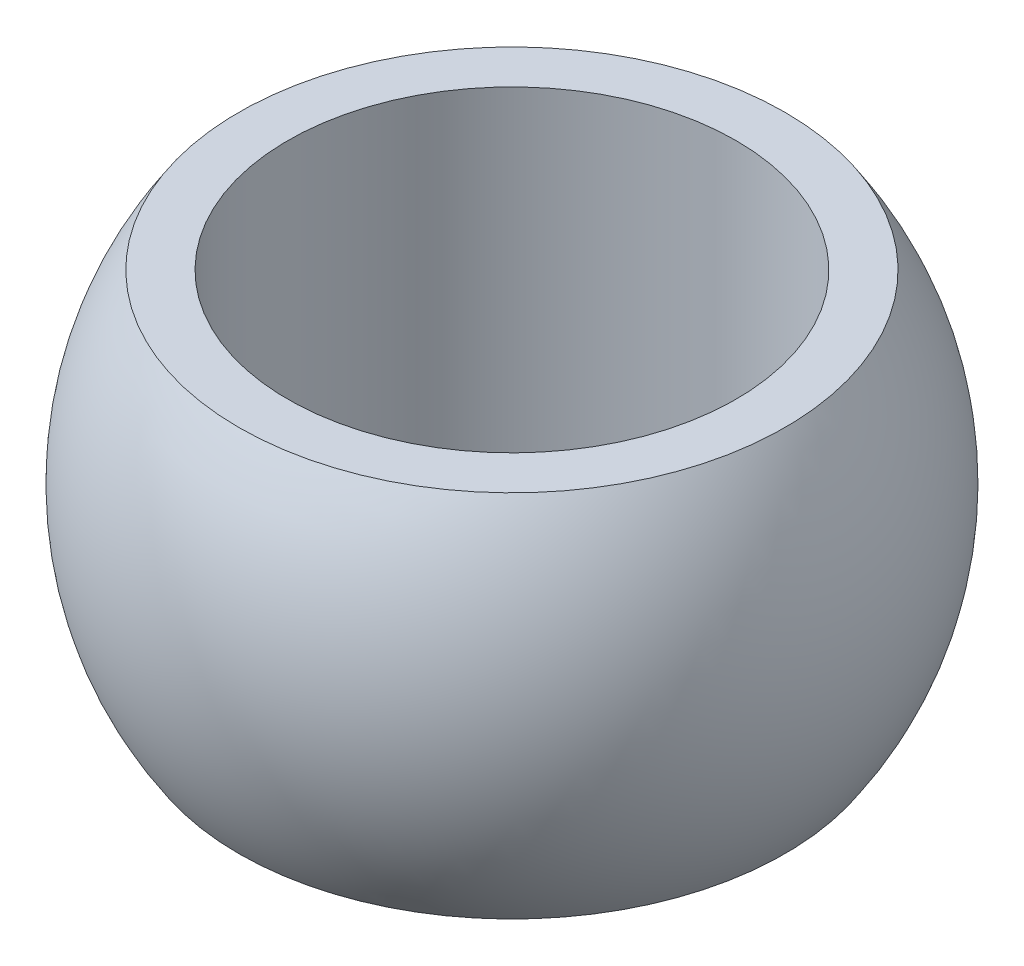
ISO-10303-21;
HEADER;
FILE_DESCRIPTION(('STEP AP214'),'2;1');
FILE_NAME('part.step','',(''),(''),'','','');
FILE_SCHEMA(('AUTOMOTIVE_DESIGN { 1 0 10303 214 1 1 1 1 }'));
ENDSEC;
DATA;
#1=APPLICATION_CONTEXT('core data for automotive mechanical design processes');
#2=APPLICATION_PROTOCOL_DEFINITION('international standard','automotive_design',2000,#1);
#3=PRODUCT_CONTEXT('',#1,'mechanical');
#4=PRODUCT('Part','Part','',(#3));
#5=PRODUCT_RELATED_PRODUCT_CATEGORY('part','',(#4));
#6=PRODUCT_DEFINITION_FORMATION('','',#4);
#7=PRODUCT_DEFINITION_CONTEXT('part definition',#1,'design');
#8=PRODUCT_DEFINITION('design','',#6,#7);
#9=PRODUCT_DEFINITION_SHAPE('','',#8);
#10=(LENGTH_UNIT() NAMED_UNIT(*) SI_UNIT(.MILLI.,.METRE.));
#11=(NAMED_UNIT(*) PLANE_ANGLE_UNIT() SI_UNIT($,.RADIAN.));
#12=(NAMED_UNIT(*) SI_UNIT($,.STERADIAN.) SOLID_ANGLE_UNIT());
#13=UNCERTAINTY_MEASURE_WITH_UNIT(LENGTH_MEASURE(1.E-05),#10,'distance_accuracy_value','');
#14=(GEOMETRIC_REPRESENTATION_CONTEXT(3) GLOBAL_UNCERTAINTY_ASSIGNED_CONTEXT((#13)) GLOBAL_UNIT_ASSIGNED_CONTEXT((#10,
#11,#12)) REPRESENTATION_CONTEXT('',''));
#15=CARTESIAN_POINT('',(0.,0.,0.));
#16=DIRECTION('',(0.,0.,1.));
#17=DIRECTION('',(1.,0.,0.));
#18=AXIS2_PLACEMENT_3D('',#15,#16,#17);
#19=CARTESIAN_POINT('',(0.,-15.339775558856,0.));
#20=DIRECTION('',(0.,-1.,0.));
#21=DIRECTION('',(0.,0.,-1.));
#22=AXIS2_PLACEMENT_3D('',#19,#20,#21);
#23=CYLINDRICAL_SURFACE('',#22,8.5);
#24=CARTESIAN_POINT('',(0.,-7.,0.));
#25=DIRECTION('',(0.,-1.,0.));
#26=DIRECTION('',(0.,0.,-1.));
#27=AXIS2_PLACEMENT_3D('',#24,#25,#26);
#28=CIRCLE('',#27,8.5);
#29=CARTESIAN_POINT('',(0.,-7.,-8.5));
#30=VERTEX_POINT('',#29);
#31=EDGE_CURVE('E10',#30,#30,#28,.T.);
#32=ORIENTED_EDGE('',*,*,#31,.T.);
#33=EDGE_LOOP('',(#32));
#34=FACE_BOUND('',#33,.T.);
#35=CARTESIAN_POINT('',(0.,7.,0.));
#36=DIRECTION('',(0.,-1.,0.));
#37=DIRECTION('',(0.,0.,-1.));
#38=AXIS2_PLACEMENT_3D('',#35,#36,#37);
#39=CIRCLE('',#38,8.5);
#40=CARTESIAN_POINT('',(0.,7.,-8.5));
#41=VERTEX_POINT('',#40);
#42=EDGE_CURVE('E51',#41,#41,#39,.T.);
#43=ORIENTED_EDGE('',*,*,#42,.F.);
#44=EDGE_LOOP('',(#43));
#45=FACE_BOUND('',#44,.T.);
#46=ADVANCED_FACE('F31',(#34,#45),#23,.F.);
#47=CARTESIAN_POINT('',(8.5,-7.,0.));
#48=DIRECTION('',(0.,-1.,0.));
#49=DIRECTION('',(0.,0.,-1.));
#50=AXIS2_PLACEMENT_3D('',#47,#48,#49);
#51=PLANE('',#50);
#52=CARTESIAN_POINT('',(0.,-7.,0.));
#53=DIRECTION('',(0.,-1.,0.));
#54=DIRECTION('',(0.,0.,-1.));
#55=AXIS2_PLACEMENT_3D('',#52,#53,#54);
#56=CIRCLE('',#55,10.356157588604);
#57=CARTESIAN_POINT('',(0.,-7.,-10.356157588604));
#58=VERTEX_POINT('',#57);
#59=EDGE_CURVE('E37',#58,#58,#56,.T.);
#60=ORIENTED_EDGE('',*,*,#59,.T.);
#61=EDGE_LOOP('',(#60));
#62=FACE_BOUND('',#61,.T.);
#63=ORIENTED_EDGE('',*,*,#31,.F.);
#64=EDGE_LOOP('',(#63));
#65=FACE_BOUND('',#64,.T.);
#66=ADVANCED_FACE('F61',(#62,#65),#51,.T.);
#67=CARTESIAN_POINT('',(0.,0.,0.));
#68=DIRECTION('',(0.,-1.,0.));
#69=DIRECTION('',(1.,0.,0.));
#70=AXIS2_PLACEMENT_3D('',#67,#68,#69);
#71=SPHERICAL_SURFACE('',#70,12.5);
#72=CARTESIAN_POINT('',(0.,7.00000000000001,0.));
#73=DIRECTION('',(0.,-1.,0.));
#74=DIRECTION('',(0.,0.,-1.));
#75=AXIS2_PLACEMENT_3D('',#72,#73,#74);
#76=CIRCLE('',#75,10.356157588604);
#77=CARTESIAN_POINT('',(0.,7.00000000000001,-10.356157588604));
#78=VERTEX_POINT('',#77);
#79=EDGE_CURVE('E42',#78,#78,#76,.T.);
#80=ORIENTED_EDGE('',*,*,#79,.T.);
#81=EDGE_LOOP('',(#80));
#82=FACE_BOUND('',#81,.T.);
#83=ORIENTED_EDGE('',*,*,#59,.F.);
#84=EDGE_LOOP('',(#83));
#85=FACE_BOUND('',#84,.T.);
#86=ADVANCED_FACE('F64',(#82,#85),#71,.T.);
#87=CARTESIAN_POINT('',(8.5,7.,0.));
#88=DIRECTION('',(0.,1.,0.));
#89=DIRECTION('',(0.,0.,1.));
#90=AXIS2_PLACEMENT_3D('',#87,#88,#89);
#91=PLANE('',#90);
#92=ORIENTED_EDGE('',*,*,#42,.T.);
#93=EDGE_LOOP('',(#92));
#94=FACE_BOUND('',#93,.T.);
#95=ORIENTED_EDGE('',*,*,#79,.F.);
#96=EDGE_LOOP('',(#95));
#97=FACE_BOUND('',#96,.T.);
#98=ADVANCED_FACE('F57',(#94,#97),#91,.T.);
#99=CLOSED_SHELL('',(#46,#66,#86,#98));
#100=MANIFOLD_SOLID_BREP('B2',#99);
#101=ADVANCED_BREP_SHAPE_REPRESENTATION('',(#18,#100),#14);
#102=SHAPE_DEFINITION_REPRESENTATION(#9,#101);
ENDSEC;
END-ISO-10303-21;
